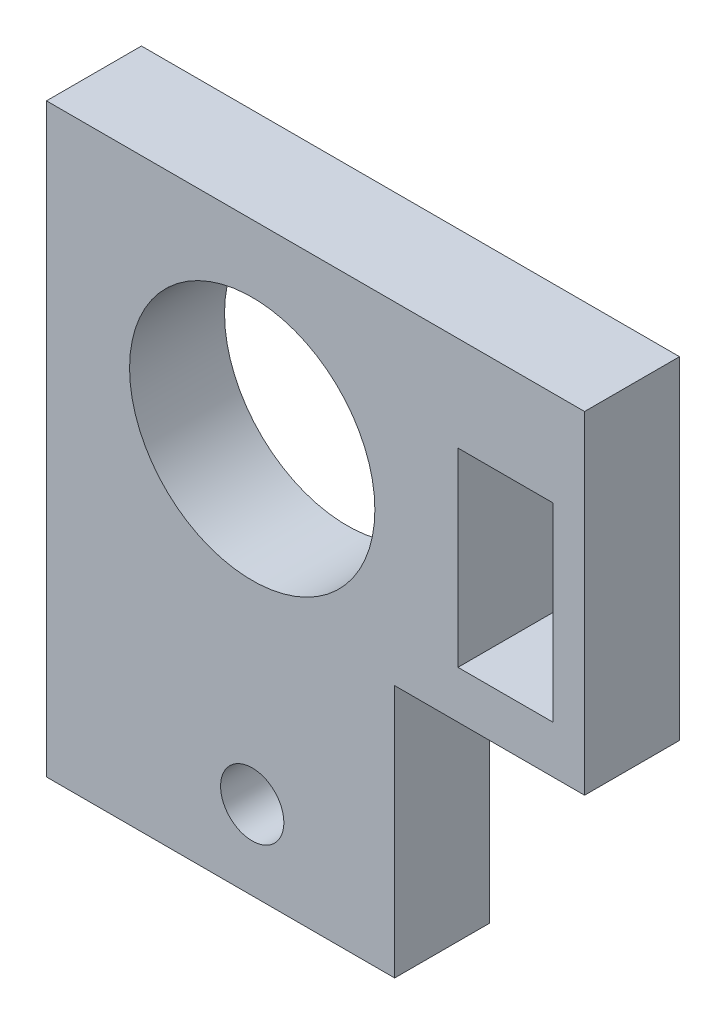
ISO-10303-21;
HEADER;
FILE_DESCRIPTION(('STEP AP214'),'2;1');
FILE_NAME('part.step','',(''),(''),'','','');
FILE_SCHEMA(('AUTOMOTIVE_DESIGN { 1 0 10303 214 1 1 1 1 }'));
ENDSEC;
DATA;
#1=APPLICATION_CONTEXT('core data for automotive mechanical design processes');
#2=APPLICATION_PROTOCOL_DEFINITION('international standard','automotive_design',2000,#1);
#3=PRODUCT_CONTEXT('',#1,'mechanical');
#4=PRODUCT('Part','Part','',(#3));
#5=PRODUCT_RELATED_PRODUCT_CATEGORY('part','',(#4));
#6=PRODUCT_DEFINITION_FORMATION('','',#4);
#7=PRODUCT_DEFINITION_CONTEXT('part definition',#1,'design');
#8=PRODUCT_DEFINITION('design','',#6,#7);
#9=PRODUCT_DEFINITION_SHAPE('','',#8);
#10=(LENGTH_UNIT() NAMED_UNIT(*) SI_UNIT(.MILLI.,.METRE.));
#11=(NAMED_UNIT(*) PLANE_ANGLE_UNIT() SI_UNIT($,.RADIAN.));
#12=(NAMED_UNIT(*) SI_UNIT($,.STERADIAN.) SOLID_ANGLE_UNIT());
#13=UNCERTAINTY_MEASURE_WITH_UNIT(LENGTH_MEASURE(1.E-05),#10,'distance_accuracy_value','');
#14=(GEOMETRIC_REPRESENTATION_CONTEXT(3) GLOBAL_UNCERTAINTY_ASSIGNED_CONTEXT((#13)) GLOBAL_UNIT_ASSIGNED_CONTEXT((#10,
#11,#12)) REPRESENTATION_CONTEXT('',''));
#15=CARTESIAN_POINT('',(0.,0.,0.));
#16=DIRECTION('',(0.,0.,1.));
#17=DIRECTION('',(1.,0.,0.));
#18=AXIS2_PLACEMENT_3D('',#15,#16,#17);
#19=CARTESIAN_POINT('',(-8.5,9.25,3.));
#20=DIRECTION('',(1.,0.,0.));
#21=DIRECTION('',(0.,1.,0.));
#22=AXIS2_PLACEMENT_3D('',#19,#20,#21);
#23=PLANE('',#22);
#24=DIRECTION('',(0.,-1.,0.));
#25=VECTOR('',#24,1.);
#26=CARTESIAN_POINT('',(-8.5,9.25,0.));
#27=LINE('',#26,#25);
#28=CARTESIAN_POINT('',(-8.5,9.25,0.));
#29=VERTEX_POINT('',#28);
#30=CARTESIAN_POINT('',(-8.5,-9.25,0.));
#31=VERTEX_POINT('',#30);
#32=EDGE_CURVE('E146',#29,#31,#27,.T.);
#33=ORIENTED_EDGE('',*,*,#32,.T.);
#34=DIRECTION('',(0.,0.,-1.));
#35=VECTOR('',#34,1.);
#36=CARTESIAN_POINT('',(-8.5,-9.25,3.));
#37=LINE('',#36,#35);
#38=CARTESIAN_POINT('',(-8.5,-9.25,3.));
#39=VERTEX_POINT('',#38);
#40=EDGE_CURVE('E11',#39,#31,#37,.T.);
#41=ORIENTED_EDGE('',*,*,#40,.F.);
#42=DIRECTION('',(0.,-1.,0.));
#43=VECTOR('',#42,1.);
#44=CARTESIAN_POINT('',(-8.5,9.25,3.));
#45=LINE('',#44,#43);
#46=CARTESIAN_POINT('',(-8.5,9.25,3.));
#47=VERTEX_POINT('',#46);
#48=EDGE_CURVE('E150',#47,#39,#45,.T.);
#49=ORIENTED_EDGE('',*,*,#48,.F.);
#50=DIRECTION('',(0.,0.,-1.));
#51=VECTOR('',#50,1.);
#52=CARTESIAN_POINT('',(-8.5,9.25,3.));
#53=LINE('',#52,#51);
#54=EDGE_CURVE('E164',#47,#29,#53,.T.);
#55=ORIENTED_EDGE('',*,*,#54,.T.);
#56=EDGE_LOOP('',(#33,#41,#49,#55));
#57=FACE_BOUND('',#56,.T.);
#58=ADVANCED_FACE('F33',(#57),#23,.F.);
#59=CARTESIAN_POINT('',(-8.5,-9.25,3.));
#60=DIRECTION('',(0.,1.,0.));
#61=DIRECTION('',(0.,0.,1.));
#62=AXIS2_PLACEMENT_3D('',#59,#60,#61);
#63=PLANE('',#62);
#64=DIRECTION('',(1.,0.,0.));
#65=VECTOR('',#64,1.);
#66=CARTESIAN_POINT('',(-8.5,-9.25,0.));
#67=LINE('',#66,#65);
#68=CARTESIAN_POINT('',(2.5,-9.25,0.));
#69=VERTEX_POINT('',#68);
#70=EDGE_CURVE('E167',#31,#69,#67,.T.);
#71=ORIENTED_EDGE('',*,*,#70,.T.);
#72=DIRECTION('',(0.,0.,-1.));
#73=VECTOR('',#72,1.);
#74=CARTESIAN_POINT('',(2.5,-9.25,3.));
#75=LINE('',#74,#73);
#76=CARTESIAN_POINT('',(2.5,-9.25,3.));
#77=VERTEX_POINT('',#76);
#78=EDGE_CURVE('E40',#77,#69,#75,.T.);
#79=ORIENTED_EDGE('',*,*,#78,.F.);
#80=DIRECTION('',(1.,0.,0.));
#81=VECTOR('',#80,1.);
#82=CARTESIAN_POINT('',(-8.5,-9.25,3.));
#83=LINE('',#82,#81);
#84=EDGE_CURVE('E153',#39,#77,#83,.T.);
#85=ORIENTED_EDGE('',*,*,#84,.F.);
#86=ORIENTED_EDGE('',*,*,#40,.T.);
#87=EDGE_LOOP('',(#71,#79,#85,#86));
#88=FACE_BOUND('',#87,.T.);
#89=ADVANCED_FACE('F212',(#88),#63,.F.);
#90=CARTESIAN_POINT('',(2.5,-9.25,3.));
#91=DIRECTION('',(-1.,0.,0.));
#92=DIRECTION('',(0.,-1.,0.));
#93=AXIS2_PLACEMENT_3D('',#90,#91,#92);
#94=PLANE('',#93);
#95=DIRECTION('',(0.,1.,0.));
#96=VECTOR('',#95,1.);
#97=CARTESIAN_POINT('',(2.5,-9.25,0.));
#98=LINE('',#97,#96);
#99=CARTESIAN_POINT('',(2.5,-1.25,0.));
#100=VERTEX_POINT('',#99);
#101=EDGE_CURVE('E169',#69,#100,#98,.T.);
#102=ORIENTED_EDGE('',*,*,#101,.T.);
#103=DIRECTION('',(0.,0.,-1.));
#104=VECTOR('',#103,1.);
#105=CARTESIAN_POINT('',(2.5,-1.25,3.));
#106=LINE('',#105,#104);
#107=CARTESIAN_POINT('',(2.5,-1.25,3.));
#108=VERTEX_POINT('',#107);
#109=EDGE_CURVE('E184',#108,#100,#106,.T.);
#110=ORIENTED_EDGE('',*,*,#109,.F.);
#111=DIRECTION('',(0.,1.,0.));
#112=VECTOR('',#111,1.);
#113=CARTESIAN_POINT('',(2.5,-9.25,3.));
#114=LINE('',#113,#112);
#115=EDGE_CURVE('E156',#77,#108,#114,.T.);
#116=ORIENTED_EDGE('',*,*,#115,.F.);
#117=ORIENTED_EDGE('',*,*,#78,.T.);
#118=EDGE_LOOP('',(#102,#110,#116,#117));
#119=FACE_BOUND('',#118,.T.);
#120=ADVANCED_FACE('F191',(#119),#94,.F.);
#121=CARTESIAN_POINT('',(2.5,-1.25,3.));
#122=DIRECTION('',(0.,1.,0.));
#123=DIRECTION('',(0.,0.,1.));
#124=AXIS2_PLACEMENT_3D('',#121,#122,#123);
#125=PLANE('',#124);
#126=DIRECTION('',(1.,0.,0.));
#127=VECTOR('',#126,1.);
#128=CARTESIAN_POINT('',(2.5,-1.25,0.));
#129=LINE('',#128,#127);
#130=CARTESIAN_POINT('',(8.5,-1.25,0.));
#131=VERTEX_POINT('',#130);
#132=EDGE_CURVE('E171',#100,#131,#129,.T.);
#133=ORIENTED_EDGE('',*,*,#132,.T.);
#134=DIRECTION('',(0.,0.,-1.));
#135=VECTOR('',#134,1.);
#136=CARTESIAN_POINT('',(8.5,-1.25,3.));
#137=LINE('',#136,#135);
#138=CARTESIAN_POINT('',(8.5,-1.25,3.));
#139=VERTEX_POINT('',#138);
#140=EDGE_CURVE('E181',#139,#131,#137,.T.);
#141=ORIENTED_EDGE('',*,*,#140,.F.);
#142=DIRECTION('',(1.,0.,0.));
#143=VECTOR('',#142,1.);
#144=CARTESIAN_POINT('',(2.5,-1.25,3.));
#145=LINE('',#144,#143);
#146=EDGE_CURVE('E158',#108,#139,#145,.T.);
#147=ORIENTED_EDGE('',*,*,#146,.F.);
#148=ORIENTED_EDGE('',*,*,#109,.T.);
#149=EDGE_LOOP('',(#133,#141,#147,#148));
#150=FACE_BOUND('',#149,.T.);
#151=ADVANCED_FACE('F200',(#150),#125,.F.);
#152=CARTESIAN_POINT('',(8.5,9.25,3.));
#153=DIRECTION('',(-1.,0.,0.));
#154=DIRECTION('',(0.,-1.,0.));
#155=AXIS2_PLACEMENT_3D('',#152,#153,#154);
#156=PLANE('',#155);
#157=DIRECTION('',(0.,1.,0.));
#158=VECTOR('',#157,1.);
#159=CARTESIAN_POINT('',(8.5,9.25,0.));
#160=LINE('',#159,#158);
#161=CARTESIAN_POINT('',(8.5,9.25,0.));
#162=VERTEX_POINT('',#161);
#163=EDGE_CURVE('E173',#131,#162,#160,.T.);
#164=ORIENTED_EDGE('',*,*,#163,.T.);
#165=DIRECTION('',(0.,0.,-1.));
#166=VECTOR('',#165,1.);
#167=CARTESIAN_POINT('',(8.5,9.25,3.));
#168=LINE('',#167,#166);
#169=CARTESIAN_POINT('',(8.5,9.25,3.));
#170=VERTEX_POINT('',#169);
#171=EDGE_CURVE('E178',#170,#162,#168,.T.);
#172=ORIENTED_EDGE('',*,*,#171,.F.);
#173=DIRECTION('',(0.,1.,0.));
#174=VECTOR('',#173,1.);
#175=CARTESIAN_POINT('',(8.5,9.25,3.));
#176=LINE('',#175,#174);
#177=EDGE_CURVE('E160',#139,#170,#176,.T.);
#178=ORIENTED_EDGE('',*,*,#177,.F.);
#179=ORIENTED_EDGE('',*,*,#140,.T.);
#180=EDGE_LOOP('',(#164,#172,#178,#179));
#181=FACE_BOUND('',#180,.T.);
#182=ADVANCED_FACE('F204',(#181),#156,.F.);
#183=CARTESIAN_POINT('',(-8.5,9.25,3.));
#184=DIRECTION('',(0.,-1.,0.));
#185=DIRECTION('',(0.,0.,-1.));
#186=AXIS2_PLACEMENT_3D('',#183,#184,#185);
#187=PLANE('',#186);
#188=DIRECTION('',(-1.,0.,0.));
#189=VECTOR('',#188,1.);
#190=CARTESIAN_POINT('',(-8.5,9.25,0.));
#191=LINE('',#190,#189);
#192=EDGE_CURVE('E154',#162,#29,#191,.T.);
#193=ORIENTED_EDGE('',*,*,#192,.T.);
#194=ORIENTED_EDGE('',*,*,#54,.F.);
#195=DIRECTION('',(-1.,0.,0.));
#196=VECTOR('',#195,1.);
#197=CARTESIAN_POINT('',(-8.5,9.25,3.));
#198=LINE('',#197,#196);
#199=EDGE_CURVE('E162',#170,#47,#198,.T.);
#200=ORIENTED_EDGE('',*,*,#199,.F.);
#201=ORIENTED_EDGE('',*,*,#171,.T.);
#202=EDGE_LOOP('',(#193,#194,#200,#201));
#203=FACE_BOUND('',#202,.T.);
#204=ADVANCED_FACE('F215',(#203),#187,.F.);
#205=CARTESIAN_POINT('',(0.,0.,3.));
#206=DIRECTION('',(0.,0.,1.));
#207=DIRECTION('',(1.,0.,0.));
#208=AXIS2_PLACEMENT_3D('',#205,#206,#207);
#209=PLANE('',#208);
#210=CARTESIAN_POINT('',(-2.,3.25,3.));
#211=DIRECTION('',(0.,0.,1.));
#212=DIRECTION('',(1.,0.,0.));
#213=AXIS2_PLACEMENT_3D('',#210,#211,#212);
#214=CIRCLE('',#213,3.875);
#215=CARTESIAN_POINT('',(1.875,3.25,3.));
#216=VERTEX_POINT('',#215);
#217=EDGE_CURVE('E326',#216,#216,#214,.T.);
#218=ORIENTED_EDGE('',*,*,#217,.F.);
#219=EDGE_LOOP('',(#218));
#220=FACE_BOUND('',#219,.T.);
#221=CARTESIAN_POINT('',(-2.,-6.75,3.));
#222=DIRECTION('',(0.,0.,1.));
#223=DIRECTION('',(1.,0.,0.));
#224=AXIS2_PLACEMENT_3D('',#221,#222,#223);
#225=CIRCLE('',#224,1.);
#226=CARTESIAN_POINT('',(-1.,-6.75,3.));
#227=VERTEX_POINT('',#226);
#228=EDGE_CURVE('E133',#227,#227,#225,.T.);
#229=ORIENTED_EDGE('',*,*,#228,.F.);
#230=EDGE_LOOP('',(#229));
#231=FACE_BOUND('',#230,.T.);
#232=DIRECTION('',(0.,-1.,0.));
#233=VECTOR('',#232,1.);
#234=CARTESIAN_POINT('',(4.5,6.25,3.));
#235=LINE('',#234,#233);
#236=CARTESIAN_POINT('',(4.5,6.25,3.));
#237=VERTEX_POINT('',#236);
#238=CARTESIAN_POINT('',(4.5,0.25,3.));
#239=VERTEX_POINT('',#238);
#240=EDGE_CURVE('E47',#237,#239,#235,.T.);
#241=ORIENTED_EDGE('',*,*,#240,.F.);
#242=DIRECTION('',(-1.,0.,0.));
#243=VECTOR('',#242,1.);
#244=CARTESIAN_POINT('',(4.5,6.25,3.));
#245=LINE('',#244,#243);
#246=CARTESIAN_POINT('',(7.5,6.25,3.));
#247=VERTEX_POINT('',#246);
#248=EDGE_CURVE('E127',#247,#237,#245,.T.);
#249=ORIENTED_EDGE('',*,*,#248,.F.);
#250=DIRECTION('',(0.,1.,0.));
#251=VECTOR('',#250,1.);
#252=CARTESIAN_POINT('',(7.5,6.25,3.));
#253=LINE('',#252,#251);
#254=CARTESIAN_POINT('',(7.5,0.250000000000001,3.));
#255=VERTEX_POINT('',#254);
#256=EDGE_CURVE('E130',#255,#247,#253,.T.);
#257=ORIENTED_EDGE('',*,*,#256,.F.);
#258=DIRECTION('',(1.,0.,0.));
#259=VECTOR('',#258,1.);
#260=CARTESIAN_POINT('',(4.5,0.25,3.));
#261=LINE('',#260,#259);
#262=EDGE_CURVE('E139',#239,#255,#261,.T.);
#263=ORIENTED_EDGE('',*,*,#262,.F.);
#264=EDGE_LOOP('',(#241,#249,#257,#263));
#265=FACE_BOUND('',#264,.T.);
#266=ORIENTED_EDGE('',*,*,#48,.T.);
#267=ORIENTED_EDGE('',*,*,#84,.T.);
#268=ORIENTED_EDGE('',*,*,#115,.T.);
#269=ORIENTED_EDGE('',*,*,#146,.T.);
#270=ORIENTED_EDGE('',*,*,#177,.T.);
#271=ORIENTED_EDGE('',*,*,#199,.T.);
#272=EDGE_LOOP('',(#266,#267,#268,#269,#270,#271));
#273=FACE_BOUND('',#272,.T.);
#274=ADVANCED_FACE('F208',(#220,#231,#265,#273),#209,.T.);
#275=CARTESIAN_POINT('',(0.,0.,0.));
#276=DIRECTION('',(0.,0.,1.));
#277=DIRECTION('',(1.,0.,0.));
#278=AXIS2_PLACEMENT_3D('',#275,#276,#277);
#279=PLANE('',#278);
#280=CARTESIAN_POINT('',(-2.,3.25,0.));
#281=DIRECTION('',(0.,0.,1.));
#282=DIRECTION('',(1.,0.,0.));
#283=AXIS2_PLACEMENT_3D('',#280,#281,#282);
#284=CIRCLE('',#283,3.875);
#285=CARTESIAN_POINT('',(1.875,3.25,0.));
#286=VERTEX_POINT('',#285);
#287=EDGE_CURVE('E140',#286,#286,#284,.T.);
#288=ORIENTED_EDGE('',*,*,#287,.T.);
#289=EDGE_LOOP('',(#288));
#290=FACE_BOUND('',#289,.T.);
#291=CARTESIAN_POINT('',(-2.,-6.75,0.));
#292=DIRECTION('',(0.,0.,1.));
#293=DIRECTION('',(1.,0.,0.));
#294=AXIS2_PLACEMENT_3D('',#291,#292,#293);
#295=CIRCLE('',#294,1.);
#296=CARTESIAN_POINT('',(-1.,-6.75,0.));
#297=VERTEX_POINT('',#296);
#298=EDGE_CURVE('E327',#297,#297,#295,.T.);
#299=ORIENTED_EDGE('',*,*,#298,.T.);
#300=EDGE_LOOP('',(#299));
#301=FACE_BOUND('',#300,.T.);
#302=DIRECTION('',(-1.,0.,0.));
#303=VECTOR('',#302,1.);
#304=CARTESIAN_POINT('',(4.5,6.25,0.));
#305=LINE('',#304,#303);
#306=CARTESIAN_POINT('',(7.5,6.25,0.));
#307=VERTEX_POINT('',#306);
#308=CARTESIAN_POINT('',(4.5,6.25,0.));
#309=VERTEX_POINT('',#308);
#310=EDGE_CURVE('E117',#307,#309,#305,.T.);
#311=ORIENTED_EDGE('',*,*,#310,.T.);
#312=DIRECTION('',(0.,-1.,0.));
#313=VECTOR('',#312,1.);
#314=CARTESIAN_POINT('',(4.5,6.25,0.));
#315=LINE('',#314,#313);
#316=CARTESIAN_POINT('',(4.5,0.25,0.));
#317=VERTEX_POINT('',#316);
#318=EDGE_CURVE('E111',#309,#317,#315,.T.);
#319=ORIENTED_EDGE('',*,*,#318,.T.);
#320=DIRECTION('',(1.,0.,0.));
#321=VECTOR('',#320,1.);
#322=CARTESIAN_POINT('',(4.5,0.25,0.));
#323=LINE('',#322,#321);
#324=CARTESIAN_POINT('',(7.5,0.250000000000001,0.));
#325=VERTEX_POINT('',#324);
#326=EDGE_CURVE('E120',#317,#325,#323,.T.);
#327=ORIENTED_EDGE('',*,*,#326,.T.);
#328=DIRECTION('',(0.,1.,0.));
#329=VECTOR('',#328,1.);
#330=CARTESIAN_POINT('',(7.5,6.25,0.));
#331=LINE('',#330,#329);
#332=EDGE_CURVE('E55',#325,#307,#331,.T.);
#333=ORIENTED_EDGE('',*,*,#332,.T.);
#334=EDGE_LOOP('',(#311,#319,#327,#333));
#335=FACE_BOUND('',#334,.T.);
#336=ORIENTED_EDGE('',*,*,#32,.F.);
#337=ORIENTED_EDGE('',*,*,#192,.F.);
#338=ORIENTED_EDGE('',*,*,#163,.F.);
#339=ORIENTED_EDGE('',*,*,#132,.F.);
#340=ORIENTED_EDGE('',*,*,#101,.F.);
#341=ORIENTED_EDGE('',*,*,#70,.F.);
#342=EDGE_LOOP('',(#336,#337,#338,#339,#340,#341));
#343=FACE_BOUND('',#342,.T.);
#344=ADVANCED_FACE('F124',(#290,#301,#335,#343),#279,.F.);
#345=CARTESIAN_POINT('',(4.5,6.25,0.));
#346=DIRECTION('',(-1.,0.,0.));
#347=DIRECTION('',(0.,0.,1.));
#348=AXIS2_PLACEMENT_3D('',#345,#346,#347);
#349=PLANE('',#348);
#350=ORIENTED_EDGE('',*,*,#240,.T.);
#351=DIRECTION('',(0.,0.,1.));
#352=VECTOR('',#351,1.);
#353=CARTESIAN_POINT('',(4.5,0.25,0.));
#354=LINE('',#353,#352);
#355=EDGE_CURVE('E107',#317,#239,#354,.T.);
#356=ORIENTED_EDGE('',*,*,#355,.F.);
#357=ORIENTED_EDGE('',*,*,#318,.F.);
#358=DIRECTION('',(0.,0.,1.));
#359=VECTOR('',#358,1.);
#360=CARTESIAN_POINT('',(4.5,6.25,0.));
#361=LINE('',#360,#359);
#362=EDGE_CURVE('E144',#309,#237,#361,.T.);
#363=ORIENTED_EDGE('',*,*,#362,.T.);
#364=EDGE_LOOP('',(#350,#356,#357,#363));
#365=FACE_BOUND('',#364,.T.);
#366=ADVANCED_FACE('F109',(#365),#349,.F.);
#367=CARTESIAN_POINT('',(4.5,6.25,0.));
#368=DIRECTION('',(0.,1.,0.));
#369=DIRECTION('',(-1.,0.,0.));
#370=AXIS2_PLACEMENT_3D('',#367,#368,#369);
#371=PLANE('',#370);
#372=ORIENTED_EDGE('',*,*,#248,.T.);
#373=ORIENTED_EDGE('',*,*,#362,.F.);
#374=ORIENTED_EDGE('',*,*,#310,.F.);
#375=DIRECTION('',(0.,0.,1.));
#376=VECTOR('',#375,1.);
#377=CARTESIAN_POINT('',(7.5,6.25,0.));
#378=LINE('',#377,#376);
#379=EDGE_CURVE('E147',#307,#247,#378,.T.);
#380=ORIENTED_EDGE('',*,*,#379,.T.);
#381=EDGE_LOOP('',(#372,#373,#374,#380));
#382=FACE_BOUND('',#381,.T.);
#383=ADVANCED_FACE('F258',(#382),#371,.F.);
#384=CARTESIAN_POINT('',(7.5,6.25,0.));
#385=DIRECTION('',(1.,0.,0.));
#386=DIRECTION('',(0.,0.,-1.));
#387=AXIS2_PLACEMENT_3D('',#384,#385,#386);
#388=PLANE('',#387);
#389=ORIENTED_EDGE('',*,*,#256,.T.);
#390=ORIENTED_EDGE('',*,*,#379,.F.);
#391=ORIENTED_EDGE('',*,*,#332,.F.);
#392=DIRECTION('',(0.,0.,1.));
#393=VECTOR('',#392,1.);
#394=CARTESIAN_POINT('',(7.5,0.250000000000001,0.));
#395=LINE('',#394,#393);
#396=EDGE_CURVE('E116',#325,#255,#395,.T.);
#397=ORIENTED_EDGE('',*,*,#396,.T.);
#398=EDGE_LOOP('',(#389,#390,#391,#397));
#399=FACE_BOUND('',#398,.T.);
#400=ADVANCED_FACE('F269',(#399),#388,.F.);
#401=CARTESIAN_POINT('',(4.5,0.25,0.));
#402=DIRECTION('',(0.,-1.,0.));
#403=DIRECTION('',(1.,0.,0.));
#404=AXIS2_PLACEMENT_3D('',#401,#402,#403);
#405=PLANE('',#404);
#406=ORIENTED_EDGE('',*,*,#262,.T.);
#407=ORIENTED_EDGE('',*,*,#396,.F.);
#408=ORIENTED_EDGE('',*,*,#326,.F.);
#409=ORIENTED_EDGE('',*,*,#355,.T.);
#410=EDGE_LOOP('',(#406,#407,#408,#409));
#411=FACE_BOUND('',#410,.T.);
#412=ADVANCED_FACE('F121',(#411),#405,.F.);
#413=CARTESIAN_POINT('',(-2.,-6.75,0.));
#414=DIRECTION('',(0.,0.,1.));
#415=DIRECTION('',(1.,0.,0.));
#416=AXIS2_PLACEMENT_3D('',#413,#414,#415);
#417=CYLINDRICAL_SURFACE('',#416,1.);
#418=ORIENTED_EDGE('',*,*,#298,.F.);
#419=EDGE_LOOP('',(#418));
#420=FACE_BOUND('',#419,.T.);
#421=ORIENTED_EDGE('',*,*,#228,.T.);
#422=EDGE_LOOP('',(#421));
#423=FACE_BOUND('',#422,.T.);
#424=ADVANCED_FACE('F287',(#420,#423),#417,.F.);
#425=CARTESIAN_POINT('',(-2.,3.25,0.));
#426=DIRECTION('',(0.,0.,1.));
#427=DIRECTION('',(1.,0.,0.));
#428=AXIS2_PLACEMENT_3D('',#425,#426,#427);
#429=CYLINDRICAL_SURFACE('',#428,3.875);
#430=ORIENTED_EDGE('',*,*,#287,.F.);
#431=EDGE_LOOP('',(#430));
#432=FACE_BOUND('',#431,.T.);
#433=ORIENTED_EDGE('',*,*,#217,.T.);
#434=EDGE_LOOP('',(#433));
#435=FACE_BOUND('',#434,.T.);
#436=ADVANCED_FACE('F307',(#432,#435),#429,.F.);
#437=CLOSED_SHELL('',(#58,#89,#120,#151,#182,#204,#274,#344,#366,#383,#400,#412,#424,#436));
#438=MANIFOLD_SOLID_BREP('B2',#437);
#439=ADVANCED_BREP_SHAPE_REPRESENTATION('',(#18,#438),#14);
#440=SHAPE_DEFINITION_REPRESENTATION(#9,#439);
ENDSEC;
END-ISO-10303-21;
